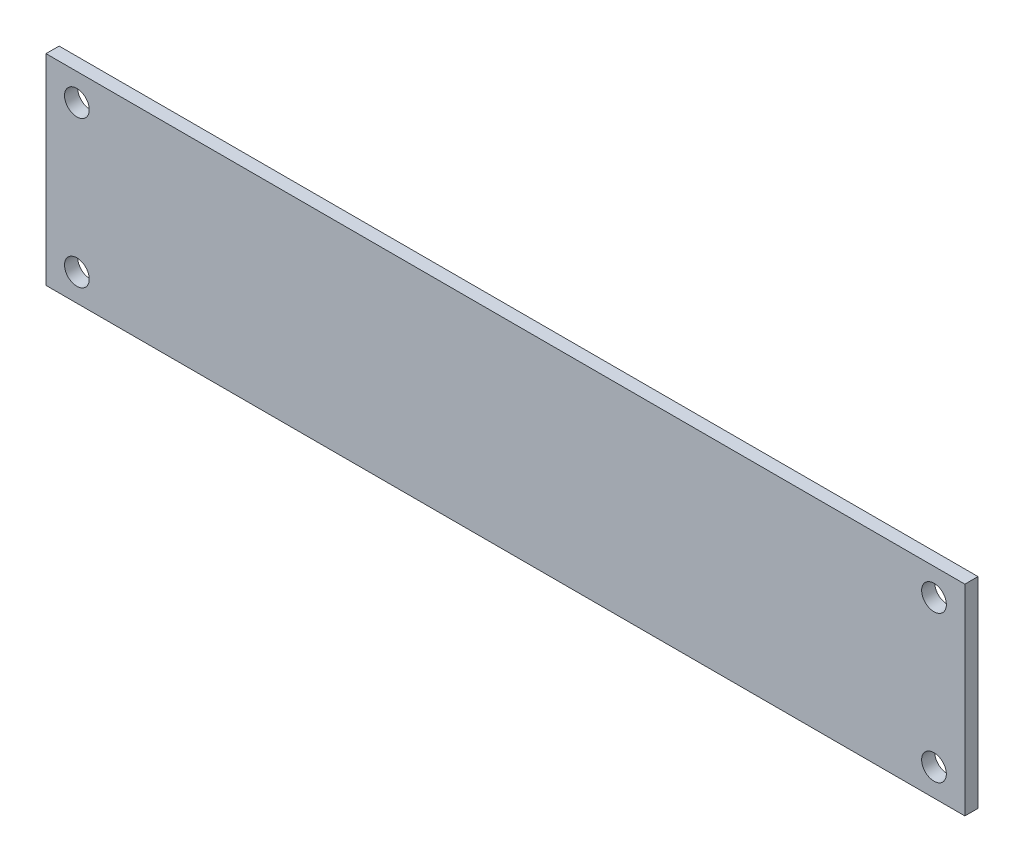
ISO-10303-21;
HEADER;
FILE_DESCRIPTION(('STEP AP214'),'2;1');
FILE_NAME('part.step','',(''),(''),'','','');
FILE_SCHEMA(('AUTOMOTIVE_DESIGN { 1 0 10303 214 1 1 1 1 }'));
ENDSEC;
DATA;
#1=APPLICATION_CONTEXT('core data for automotive mechanical design processes');
#2=APPLICATION_PROTOCOL_DEFINITION('international standard','automotive_design',2000,#1);
#3=PRODUCT_CONTEXT('',#1,'mechanical');
#4=PRODUCT('Part','Part','',(#3));
#5=PRODUCT_RELATED_PRODUCT_CATEGORY('part','',(#4));
#6=PRODUCT_DEFINITION_FORMATION('','',#4);
#7=PRODUCT_DEFINITION_CONTEXT('part definition',#1,'design');
#8=PRODUCT_DEFINITION('design','',#6,#7);
#9=PRODUCT_DEFINITION_SHAPE('','',#8);
#10=(LENGTH_UNIT() NAMED_UNIT(*) SI_UNIT(.MILLI.,.METRE.));
#11=(NAMED_UNIT(*) PLANE_ANGLE_UNIT() SI_UNIT($,.RADIAN.));
#12=(NAMED_UNIT(*) SI_UNIT($,.STERADIAN.) SOLID_ANGLE_UNIT());
#13=UNCERTAINTY_MEASURE_WITH_UNIT(LENGTH_MEASURE(1.E-05),#10,'distance_accuracy_value','');
#14=(GEOMETRIC_REPRESENTATION_CONTEXT(3) GLOBAL_UNCERTAINTY_ASSIGNED_CONTEXT((#13)) GLOBAL_UNIT_ASSIGNED_CONTEXT((#10,
#11,#12)) REPRESENTATION_CONTEXT('',''));
#15=CARTESIAN_POINT('',(0.,0.,0.));
#16=DIRECTION('',(0.,0.,1.));
#17=DIRECTION('',(1.,0.,0.));
#18=AXIS2_PLACEMENT_3D('',#15,#16,#17);
#19=CARTESIAN_POINT('',(0.,0.,1.7));
#20=DIRECTION('',(0.,0.,1.));
#21=DIRECTION('',(1.,0.,0.));
#22=AXIS2_PLACEMENT_3D('',#19,#20,#21);
#23=PLANE('',#22);
#24=CARTESIAN_POINT('',(55.5,-9.5,1.7));
#25=DIRECTION('',(0.,0.,1.));
#26=DIRECTION('',(1.,0.,0.));
#27=AXIS2_PLACEMENT_3D('',#24,#25,#26);
#28=CIRCLE('',#27,1.6);
#29=CARTESIAN_POINT('',(57.1,-9.5,1.7));
#30=VERTEX_POINT('',#29);
#31=EDGE_CURVE('E121',#30,#30,#28,.T.);
#32=ORIENTED_EDGE('',*,*,#31,.F.);
#33=EDGE_LOOP('',(#32));
#34=FACE_BOUND('',#33,.T.);
#35=CARTESIAN_POINT('',(-55.5,-9.5,1.7));
#36=DIRECTION('',(0.,0.,1.));
#37=DIRECTION('',(1.,0.,0.));
#38=AXIS2_PLACEMENT_3D('',#35,#36,#37);
#39=CIRCLE('',#38,1.6);
#40=CARTESIAN_POINT('',(-53.9,-9.5,1.7));
#41=VERTEX_POINT('',#40);
#42=EDGE_CURVE('E100',#41,#41,#39,.T.);
#43=ORIENTED_EDGE('',*,*,#42,.F.);
#44=EDGE_LOOP('',(#43));
#45=FACE_BOUND('',#44,.T.);
#46=DIRECTION('',(0.,-1.,0.));
#47=VECTOR('',#46,1.);
#48=CARTESIAN_POINT('',(-59.5,13.,1.7));
#49=LINE('',#48,#47);
#50=CARTESIAN_POINT('',(-59.5,13.,1.7));
#51=VERTEX_POINT('',#50);
#52=CARTESIAN_POINT('',(-59.5,-13.,1.7));
#53=VERTEX_POINT('',#52);
#54=EDGE_CURVE('E85',#51,#53,#49,.T.);
#55=ORIENTED_EDGE('',*,*,#54,.T.);
#56=DIRECTION('',(1.,0.,0.));
#57=VECTOR('',#56,1.);
#58=CARTESIAN_POINT('',(-59.5,-13.,1.7));
#59=LINE('',#58,#57);
#60=CARTESIAN_POINT('',(59.5,-13.,1.7));
#61=VERTEX_POINT('',#60);
#62=EDGE_CURVE('E80',#53,#61,#59,.T.);
#63=ORIENTED_EDGE('',*,*,#62,.T.);
#64=DIRECTION('',(0.,1.,0.));
#65=VECTOR('',#64,1.);
#66=CARTESIAN_POINT('',(59.5,13.,1.7));
#67=LINE('',#66,#65);
#68=CARTESIAN_POINT('',(59.5,13.,1.7));
#69=VERTEX_POINT('',#68);
#70=EDGE_CURVE('E83',#61,#69,#67,.T.);
#71=ORIENTED_EDGE('',*,*,#70,.T.);
#72=DIRECTION('',(-1.,0.,0.));
#73=VECTOR('',#72,1.);
#74=CARTESIAN_POINT('',(-59.5,13.,1.7));
#75=LINE('',#74,#73);
#76=EDGE_CURVE('E50',#69,#51,#75,.T.);
#77=ORIENTED_EDGE('',*,*,#76,.T.);
#78=EDGE_LOOP('',(#55,#63,#71,#77));
#79=FACE_BOUND('',#78,.T.);
#80=CARTESIAN_POINT('',(-55.5,9.5,1.7));
#81=DIRECTION('',(0.,0.,1.));
#82=DIRECTION('',(1.,0.,0.));
#83=AXIS2_PLACEMENT_3D('',#80,#81,#82);
#84=CIRCLE('',#83,1.6);
#85=CARTESIAN_POINT('',(-53.9,9.5,1.7));
#86=VERTEX_POINT('',#85);
#87=EDGE_CURVE('E115',#86,#86,#84,.T.);
#88=ORIENTED_EDGE('',*,*,#87,.F.);
#89=EDGE_LOOP('',(#88));
#90=FACE_BOUND('',#89,.T.);
#91=CARTESIAN_POINT('',(55.5,9.5,1.7));
#92=DIRECTION('',(0.,0.,1.));
#93=DIRECTION('',(1.,0.,0.));
#94=AXIS2_PLACEMENT_3D('',#91,#92,#93);
#95=CIRCLE('',#94,1.6);
#96=CARTESIAN_POINT('',(57.1,9.5,1.7));
#97=VERTEX_POINT('',#96);
#98=EDGE_CURVE('E127',#97,#97,#95,.T.);
#99=ORIENTED_EDGE('',*,*,#98,.F.);
#100=EDGE_LOOP('',(#99));
#101=FACE_BOUND('',#100,.T.);
#102=ADVANCED_FACE('F33',(#34,#45,#79,#90,#101),#23,.T.);
#103=CARTESIAN_POINT('',(0.,0.,0.));
#104=DIRECTION('',(0.,0.,1.));
#105=DIRECTION('',(1.,0.,0.));
#106=AXIS2_PLACEMENT_3D('',#103,#104,#105);
#107=PLANE('',#106);
#108=DIRECTION('',(0.,-1.,0.));
#109=VECTOR('',#108,1.);
#110=CARTESIAN_POINT('',(-59.5,13.,0.));
#111=LINE('',#110,#109);
#112=CARTESIAN_POINT('',(-59.5,13.,0.));
#113=VERTEX_POINT('',#112);
#114=CARTESIAN_POINT('',(-59.5,-13.,0.));
#115=VERTEX_POINT('',#114);
#116=EDGE_CURVE('E97',#113,#115,#111,.T.);
#117=ORIENTED_EDGE('',*,*,#116,.F.);
#118=DIRECTION('',(-1.,0.,0.));
#119=VECTOR('',#118,1.);
#120=CARTESIAN_POINT('',(-59.5,13.,0.));
#121=LINE('',#120,#119);
#122=CARTESIAN_POINT('',(59.5,13.,0.));
#123=VERTEX_POINT('',#122);
#124=EDGE_CURVE('E73',#123,#113,#121,.T.);
#125=ORIENTED_EDGE('',*,*,#124,.F.);
#126=DIRECTION('',(0.,1.,0.));
#127=VECTOR('',#126,1.);
#128=CARTESIAN_POINT('',(59.5,13.,0.));
#129=LINE('',#128,#127);
#130=CARTESIAN_POINT('',(59.5,-13.,0.));
#131=VERTEX_POINT('',#130);
#132=EDGE_CURVE('E67',#131,#123,#129,.T.);
#133=ORIENTED_EDGE('',*,*,#132,.F.);
#134=DIRECTION('',(1.,0.,0.));
#135=VECTOR('',#134,1.);
#136=CARTESIAN_POINT('',(-59.5,-13.,0.));
#137=LINE('',#136,#135);
#138=EDGE_CURVE('E89',#115,#131,#137,.T.);
#139=ORIENTED_EDGE('',*,*,#138,.F.);
#140=EDGE_LOOP('',(#117,#125,#133,#139));
#141=FACE_BOUND('',#140,.T.);
#142=CARTESIAN_POINT('',(-55.5,-9.5,0.));
#143=DIRECTION('',(0.,0.,1.));
#144=DIRECTION('',(1.,0.,0.));
#145=AXIS2_PLACEMENT_3D('',#142,#143,#144);
#146=CIRCLE('',#145,1.6);
#147=CARTESIAN_POINT('',(-53.9,-9.5,0.));
#148=VERTEX_POINT('',#147);
#149=EDGE_CURVE('E112',#148,#148,#146,.T.);
#150=ORIENTED_EDGE('',*,*,#149,.T.);
#151=EDGE_LOOP('',(#150));
#152=FACE_BOUND('',#151,.T.);
#153=CARTESIAN_POINT('',(-55.5,9.5,0.));
#154=DIRECTION('',(0.,0.,1.));
#155=DIRECTION('',(1.,0.,0.));
#156=AXIS2_PLACEMENT_3D('',#153,#154,#155);
#157=CIRCLE('',#156,1.6);
#158=CARTESIAN_POINT('',(-53.9,9.5,0.));
#159=VERTEX_POINT('',#158);
#160=EDGE_CURVE('E118',#159,#159,#157,.T.);
#161=ORIENTED_EDGE('',*,*,#160,.T.);
#162=EDGE_LOOP('',(#161));
#163=FACE_BOUND('',#162,.T.);
#164=CARTESIAN_POINT('',(55.5,-9.5,0.));
#165=DIRECTION('',(0.,0.,1.));
#166=DIRECTION('',(1.,0.,0.));
#167=AXIS2_PLACEMENT_3D('',#164,#165,#166);
#168=CIRCLE('',#167,1.6);
#169=CARTESIAN_POINT('',(57.1,-9.5,0.));
#170=VERTEX_POINT('',#169);
#171=EDGE_CURVE('E124',#170,#170,#168,.T.);
#172=ORIENTED_EDGE('',*,*,#171,.T.);
#173=EDGE_LOOP('',(#172));
#174=FACE_BOUND('',#173,.T.);
#175=CARTESIAN_POINT('',(55.5,9.5,0.));
#176=DIRECTION('',(0.,0.,1.));
#177=DIRECTION('',(1.,0.,0.));
#178=AXIS2_PLACEMENT_3D('',#175,#176,#177);
#179=CIRCLE('',#178,1.6);
#180=CARTESIAN_POINT('',(57.1,9.5,0.));
#181=VERTEX_POINT('',#180);
#182=EDGE_CURVE('E130',#181,#181,#179,.T.);
#183=ORIENTED_EDGE('',*,*,#182,.T.);
#184=EDGE_LOOP('',(#183));
#185=FACE_BOUND('',#184,.T.);
#186=ADVANCED_FACE('F108',(#141,#152,#163,#174,#185),#107,.F.);
#187=CARTESIAN_POINT('',(-59.5,13.,1.7));
#188=DIRECTION('',(1.,0.,0.));
#189=DIRECTION('',(0.,0.,-1.));
#190=AXIS2_PLACEMENT_3D('',#187,#188,#189);
#191=PLANE('',#190);
#192=ORIENTED_EDGE('',*,*,#116,.T.);
#193=DIRECTION('',(0.,0.,-1.));
#194=VECTOR('',#193,1.);
#195=CARTESIAN_POINT('',(-59.5,-13.,1.7));
#196=LINE('',#195,#194);
#197=EDGE_CURVE('E11',#53,#115,#196,.T.);
#198=ORIENTED_EDGE('',*,*,#197,.F.);
#199=ORIENTED_EDGE('',*,*,#54,.F.);
#200=DIRECTION('',(0.,0.,-1.));
#201=VECTOR('',#200,1.);
#202=CARTESIAN_POINT('',(-59.5,13.,1.7));
#203=LINE('',#202,#201);
#204=EDGE_CURVE('E93',#51,#113,#203,.T.);
#205=ORIENTED_EDGE('',*,*,#204,.T.);
#206=EDGE_LOOP('',(#192,#198,#199,#205));
#207=FACE_BOUND('',#206,.T.);
#208=ADVANCED_FACE('F35',(#207),#191,.F.);
#209=CARTESIAN_POINT('',(-59.5,-13.,1.7));
#210=DIRECTION('',(0.,1.,0.));
#211=DIRECTION('',(0.,0.,1.));
#212=AXIS2_PLACEMENT_3D('',#209,#210,#211);
#213=PLANE('',#212);
#214=ORIENTED_EDGE('',*,*,#138,.T.);
#215=DIRECTION('',(0.,0.,-1.));
#216=VECTOR('',#215,1.);
#217=CARTESIAN_POINT('',(59.5,-13.,1.7));
#218=LINE('',#217,#216);
#219=EDGE_CURVE('E42',#61,#131,#218,.T.);
#220=ORIENTED_EDGE('',*,*,#219,.F.);
#221=ORIENTED_EDGE('',*,*,#62,.F.);
#222=ORIENTED_EDGE('',*,*,#197,.T.);
#223=EDGE_LOOP('',(#214,#220,#221,#222));
#224=FACE_BOUND('',#223,.T.);
#225=ADVANCED_FACE('F88',(#224),#213,.F.);
#226=CARTESIAN_POINT('',(59.5,13.,1.7));
#227=DIRECTION('',(-1.,0.,0.));
#228=DIRECTION('',(0.,0.,1.));
#229=AXIS2_PLACEMENT_3D('',#226,#227,#228);
#230=PLANE('',#229);
#231=ORIENTED_EDGE('',*,*,#132,.T.);
#232=DIRECTION('',(0.,0.,-1.));
#233=VECTOR('',#232,1.);
#234=CARTESIAN_POINT('',(59.5,13.,1.7));
#235=LINE('',#234,#233);
#236=EDGE_CURVE('E90',#69,#123,#235,.T.);
#237=ORIENTED_EDGE('',*,*,#236,.F.);
#238=ORIENTED_EDGE('',*,*,#70,.F.);
#239=ORIENTED_EDGE('',*,*,#219,.T.);
#240=EDGE_LOOP('',(#231,#237,#238,#239));
#241=FACE_BOUND('',#240,.T.);
#242=ADVANCED_FACE('F91',(#241),#230,.F.);
#243=CARTESIAN_POINT('',(-59.5,13.,1.7));
#244=DIRECTION('',(0.,-1.,0.));
#245=DIRECTION('',(0.,0.,-1.));
#246=AXIS2_PLACEMENT_3D('',#243,#244,#245);
#247=PLANE('',#246);
#248=ORIENTED_EDGE('',*,*,#124,.T.);
#249=ORIENTED_EDGE('',*,*,#204,.F.);
#250=ORIENTED_EDGE('',*,*,#76,.F.);
#251=ORIENTED_EDGE('',*,*,#236,.T.);
#252=EDGE_LOOP('',(#248,#249,#250,#251));
#253=FACE_BOUND('',#252,.T.);
#254=ADVANCED_FACE('F105',(#253),#247,.F.);
#255=CARTESIAN_POINT('',(-55.5,-9.5,1.7));
#256=DIRECTION('',(0.,0.,-1.));
#257=DIRECTION('',(-1.,0.,0.));
#258=AXIS2_PLACEMENT_3D('',#255,#256,#257);
#259=CYLINDRICAL_SURFACE('',#258,1.6);
#260=ORIENTED_EDGE('',*,*,#42,.T.);
#261=EDGE_LOOP('',(#260));
#262=FACE_BOUND('',#261,.T.);
#263=ORIENTED_EDGE('',*,*,#149,.F.);
#264=EDGE_LOOP('',(#263));
#265=FACE_BOUND('',#264,.T.);
#266=ADVANCED_FACE('F149',(#262,#265),#259,.F.);
#267=CARTESIAN_POINT('',(-55.5,9.5,1.7));
#268=DIRECTION('',(0.,0.,-1.));
#269=DIRECTION('',(-1.,0.,0.));
#270=AXIS2_PLACEMENT_3D('',#267,#268,#269);
#271=CYLINDRICAL_SURFACE('',#270,1.6);
#272=ORIENTED_EDGE('',*,*,#87,.T.);
#273=EDGE_LOOP('',(#272));
#274=FACE_BOUND('',#273,.T.);
#275=ORIENTED_EDGE('',*,*,#160,.F.);
#276=EDGE_LOOP('',(#275));
#277=FACE_BOUND('',#276,.T.);
#278=ADVANCED_FACE('F195',(#274,#277),#271,.F.);
#279=CARTESIAN_POINT('',(55.5,-9.5,1.7));
#280=DIRECTION('',(0.,0.,-1.));
#281=DIRECTION('',(-1.,0.,0.));
#282=AXIS2_PLACEMENT_3D('',#279,#280,#281);
#283=CYLINDRICAL_SURFACE('',#282,1.6);
#284=ORIENTED_EDGE('',*,*,#31,.T.);
#285=EDGE_LOOP('',(#284));
#286=FACE_BOUND('',#285,.T.);
#287=ORIENTED_EDGE('',*,*,#171,.F.);
#288=EDGE_LOOP('',(#287));
#289=FACE_BOUND('',#288,.T.);
#290=ADVANCED_FACE('F203',(#286,#289),#283,.F.);
#291=CARTESIAN_POINT('',(55.5,9.5,1.7));
#292=DIRECTION('',(0.,0.,-1.));
#293=DIRECTION('',(-1.,0.,0.));
#294=AXIS2_PLACEMENT_3D('',#291,#292,#293);
#295=CYLINDRICAL_SURFACE('',#294,1.6);
#296=ORIENTED_EDGE('',*,*,#98,.T.);
#297=EDGE_LOOP('',(#296));
#298=FACE_BOUND('',#297,.T.);
#299=ORIENTED_EDGE('',*,*,#182,.F.);
#300=EDGE_LOOP('',(#299));
#301=FACE_BOUND('',#300,.T.);
#302=ADVANCED_FACE('F136',(#298,#301),#295,.F.);
#303=CLOSED_SHELL('',(#102,#186,#208,#225,#242,#254,#266,#278,#290,#302));
#304=MANIFOLD_SOLID_BREP('B2',#303);
#305=ADVANCED_BREP_SHAPE_REPRESENTATION('',(#18,#304),#14);
#306=SHAPE_DEFINITION_REPRESENTATION(#9,#305);
ENDSEC;
END-ISO-10303-21;
